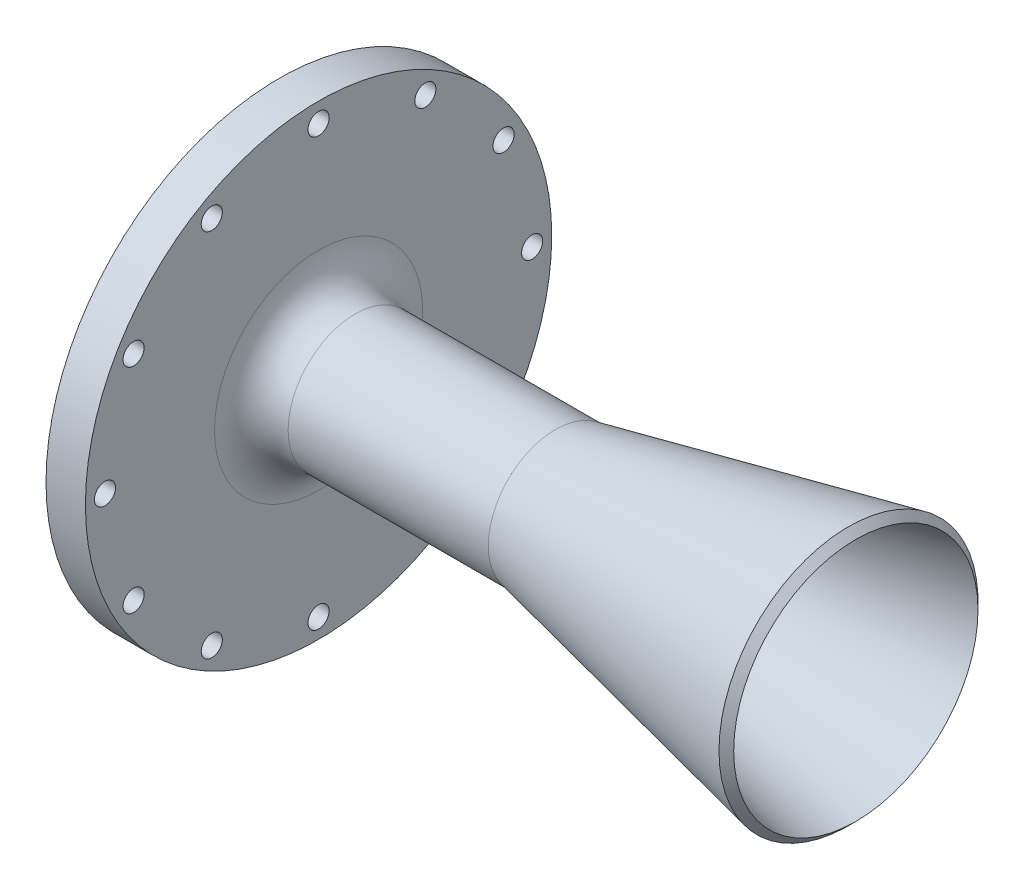
ISO-10303-21;
HEADER;
FILE_DESCRIPTION(('STEP AP214'),'2;1');
FILE_NAME('part.step','',(''),(''),'','','');
FILE_SCHEMA(('AUTOMOTIVE_DESIGN { 1 0 10303 214 1 1 1 1 }'));
ENDSEC;
DATA;
#1=APPLICATION_CONTEXT('core data for automotive mechanical design processes');
#2=APPLICATION_PROTOCOL_DEFINITION('international standard','automotive_design',2000,#1);
#3=PRODUCT_CONTEXT('',#1,'mechanical');
#4=PRODUCT('Part','Part','',(#3));
#5=PRODUCT_RELATED_PRODUCT_CATEGORY('part','',(#4));
#6=PRODUCT_DEFINITION_FORMATION('','',#4);
#7=PRODUCT_DEFINITION_CONTEXT('part definition',#1,'design');
#8=PRODUCT_DEFINITION('design','',#6,#7);
#9=PRODUCT_DEFINITION_SHAPE('','',#8);
#10=(LENGTH_UNIT() NAMED_UNIT(*) SI_UNIT(.MILLI.,.METRE.));
#11=(NAMED_UNIT(*) PLANE_ANGLE_UNIT() SI_UNIT($,.RADIAN.));
#12=(NAMED_UNIT(*) SI_UNIT($,.STERADIAN.) SOLID_ANGLE_UNIT());
#13=UNCERTAINTY_MEASURE_WITH_UNIT(LENGTH_MEASURE(1.E-05),#10,'distance_accuracy_value','');
#14=(GEOMETRIC_REPRESENTATION_CONTEXT(3) GLOBAL_UNCERTAINTY_ASSIGNED_CONTEXT((#13)) GLOBAL_UNIT_ASSIGNED_CONTEXT((#10,
#11,#12)) REPRESENTATION_CONTEXT('',''));
#15=CARTESIAN_POINT('',(0.,0.,0.));
#16=DIRECTION('',(0.,0.,1.));
#17=DIRECTION('',(1.,0.,0.));
#18=AXIS2_PLACEMENT_3D('',#15,#16,#17);
#19=CARTESIAN_POINT('',(0.,20.583496155902,0.));
#20=DIRECTION('',(1.,0.,0.));
#21=DIRECTION('',(0.,0.,-1.));
#22=AXIS2_PLACEMENT_3D('',#19,#20,#21);
#23=PLANE('',#22);
#24=CARTESIAN_POINT('',(0.,0.,0.));
#25=DIRECTION('',(1.,0.,0.));
#26=DIRECTION('',(0.,0.,-1.));
#27=AXIS2_PLACEMENT_3D('',#24,#25,#26);
#28=CIRCLE('',#27,36.);
#29=CARTESIAN_POINT('',(0.,0.,-36.));
#30=VERTEX_POINT('',#29);
#31=EDGE_CURVE('E212',#30,#30,#28,.T.);
#32=ORIENTED_EDGE('',*,*,#31,.T.);
#33=EDGE_LOOP('',(#32));
#34=FACE_BOUND('',#33,.T.);
#35=CARTESIAN_POINT('',(0.,0.,0.));
#36=DIRECTION('',(-1.,0.,0.));
#37=DIRECTION('',(0.,0.,1.));
#38=AXIS2_PLACEMENT_3D('',#35,#36,#37);
#39=CIRCLE('',#38,40.9575);
#40=CARTESIAN_POINT('',(0.,0.,40.9575));
#41=VERTEX_POINT('',#40);
#42=EDGE_CURVE('E566',#41,#41,#39,.T.);
#43=ORIENTED_EDGE('',*,*,#42,.T.);
#44=EDGE_LOOP('',(#43));
#45=FACE_BOUND('',#44,.T.);
#46=ADVANCED_FACE('F40',(#34,#45),#23,.F.);
#47=CARTESIAN_POINT('',(0.,0.,0.));
#48=DIRECTION('',(-1.,0.,0.));
#49=DIRECTION('',(0.,0.,1.));
#50=AXIS2_PLACEMENT_3D('',#47,#48,#49);
#51=CIRCLE('',#50,46.2915);
#52=CARTESIAN_POINT('',(0.,0.,46.2915));
#53=VERTEX_POINT('',#52);
#54=EDGE_CURVE('E570',#53,#53,#51,.T.);
#55=ORIENTED_EDGE('',*,*,#54,.F.);
#56=EDGE_LOOP('',(#55));
#57=FACE_BOUND('',#56,.T.);
#58=CARTESIAN_POINT('',(0.,-13.3616626129386,49.8664037450867));
#59=DIRECTION('',(-1.,0.,0.));
#60=DIRECTION('',(0.,0.,1.));
#61=AXIS2_PLACEMENT_3D('',#58,#59,#60);
#62=CIRCLE('',#61,2.38125);
#63=CARTESIAN_POINT('',(0.,-13.3616626129386,52.2476537450867));
#64=VERTEX_POINT('',#63);
#65=EDGE_CURVE('E67',#64,#64,#62,.T.);
#66=ORIENTED_EDGE('',*,*,#65,.F.);
#67=EDGE_LOOP('',(#66));
#68=FACE_BOUND('',#67,.T.);
#69=CARTESIAN_POINT('',(0.,13.3616626129382,-49.8664037450868));
#70=DIRECTION('',(-1.,0.,0.));
#71=DIRECTION('',(0.,0.,1.));
#72=AXIS2_PLACEMENT_3D('',#69,#70,#71);
#73=CIRCLE('',#72,2.38125);
#74=CARTESIAN_POINT('',(0.,13.3616626129382,-47.4851537450868));
#75=VERTEX_POINT('',#74);
#76=EDGE_CURVE('E66',#75,#75,#73,.T.);
#77=ORIENTED_EDGE('',*,*,#76,.F.);
#78=EDGE_LOOP('',(#77));
#79=FACE_BOUND('',#78,.T.);
#80=CARTESIAN_POINT('',(0.,-44.7089944830735,-25.81275));
#81=DIRECTION('',(-1.,0.,0.));
#82=DIRECTION('',(0.,0.,1.));
#83=AXIS2_PLACEMENT_3D('',#80,#81,#82);
#84=CIRCLE('',#83,2.5527);
#85=CARTESIAN_POINT('',(0.,-44.7089944830735,-23.26005));
#86=VERTEX_POINT('',#85);
#87=EDGE_CURVE('E90',#86,#86,#84,.T.);
#88=ORIENTED_EDGE('',*,*,#87,.F.);
#89=EDGE_LOOP('',(#88));
#90=FACE_BOUND('',#89,.T.);
#91=CARTESIAN_POINT('',(0.,-25.81275,-44.7089944830735));
#92=DIRECTION('',(-1.,0.,0.));
#93=DIRECTION('',(0.,0.,1.));
#94=AXIS2_PLACEMENT_3D('',#91,#92,#93);
#95=CIRCLE('',#94,2.5527);
#96=CARTESIAN_POINT('',(0.,-25.81275,-42.1562944830735));
#97=VERTEX_POINT('',#96);
#98=EDGE_CURVE('E98',#97,#97,#95,.T.);
#99=ORIENTED_EDGE('',*,*,#98,.F.);
#100=EDGE_LOOP('',(#99));
#101=FACE_BOUND('',#100,.T.);
#102=CARTESIAN_POINT('',(0.,0.,-51.6255));
#103=DIRECTION('',(-1.,0.,0.));
#104=DIRECTION('',(0.,0.,1.));
#105=AXIS2_PLACEMENT_3D('',#102,#103,#104);
#106=CIRCLE('',#105,2.5527);
#107=CARTESIAN_POINT('',(0.,0.,-49.0728));
#108=VERTEX_POINT('',#107);
#109=EDGE_CURVE('E106',#108,#108,#106,.T.);
#110=ORIENTED_EDGE('',*,*,#109,.F.);
#111=EDGE_LOOP('',(#110));
#112=FACE_BOUND('',#111,.T.);
#113=CARTESIAN_POINT('',(0.,25.81275,-44.7089944830735));
#114=DIRECTION('',(-1.,0.,0.));
#115=DIRECTION('',(0.,0.,1.));
#116=AXIS2_PLACEMENT_3D('',#113,#114,#115);
#117=CIRCLE('',#116,2.5527);
#118=CARTESIAN_POINT('',(0.,25.81275,-42.1562944830736));
#119=VERTEX_POINT('',#118);
#120=EDGE_CURVE('E114',#119,#119,#117,.T.);
#121=ORIENTED_EDGE('',*,*,#120,.F.);
#122=EDGE_LOOP('',(#121));
#123=FACE_BOUND('',#122,.T.);
#124=CARTESIAN_POINT('',(0.,44.7089944830735,-25.81275));
#125=DIRECTION('',(-1.,0.,0.));
#126=DIRECTION('',(0.,0.,1.));
#127=AXIS2_PLACEMENT_3D('',#124,#125,#126);
#128=CIRCLE('',#127,2.5527);
#129=CARTESIAN_POINT('',(0.,44.7089944830735,-23.26005));
#130=VERTEX_POINT('',#129);
#131=EDGE_CURVE('E122',#130,#130,#128,.T.);
#132=ORIENTED_EDGE('',*,*,#131,.F.);
#133=EDGE_LOOP('',(#132));
#134=FACE_BOUND('',#133,.T.);
#135=CARTESIAN_POINT('',(0.,51.6255,0.));
#136=DIRECTION('',(-1.,0.,0.));
#137=DIRECTION('',(0.,0.,1.));
#138=AXIS2_PLACEMENT_3D('',#135,#136,#137);
#139=CIRCLE('',#138,2.5527);
#140=CARTESIAN_POINT('',(0.,51.6255,2.5527));
#141=VERTEX_POINT('',#140);
#142=EDGE_CURVE('E130',#141,#141,#139,.T.);
#143=ORIENTED_EDGE('',*,*,#142,.F.);
#144=EDGE_LOOP('',(#143));
#145=FACE_BOUND('',#144,.T.);
#146=CARTESIAN_POINT('',(0.,25.81275,44.7089944830735));
#147=DIRECTION('',(-1.,0.,0.));
#148=DIRECTION('',(0.,0.,1.));
#149=AXIS2_PLACEMENT_3D('',#146,#147,#148);
#150=CIRCLE('',#149,2.5527);
#151=CARTESIAN_POINT('',(0.,25.81275,47.2616944830735));
#152=VERTEX_POINT('',#151);
#153=EDGE_CURVE('E146',#152,#152,#150,.T.);
#154=ORIENTED_EDGE('',*,*,#153,.F.);
#155=EDGE_LOOP('',(#154));
#156=FACE_BOUND('',#155,.T.);
#157=CARTESIAN_POINT('',(0.,0.,51.6255));
#158=DIRECTION('',(-1.,0.,0.));
#159=DIRECTION('',(0.,0.,1.));
#160=AXIS2_PLACEMENT_3D('',#157,#158,#159);
#161=CIRCLE('',#160,2.5527);
#162=CARTESIAN_POINT('',(0.,0.,54.1782));
#163=VERTEX_POINT('',#162);
#164=EDGE_CURVE('E154',#163,#163,#161,.T.);
#165=ORIENTED_EDGE('',*,*,#164,.F.);
#166=EDGE_LOOP('',(#165));
#167=FACE_BOUND('',#166,.T.);
#168=CARTESIAN_POINT('',(0.,-25.81275,44.7089944830736));
#169=DIRECTION('',(-1.,0.,0.));
#170=DIRECTION('',(0.,0.,1.));
#171=AXIS2_PLACEMENT_3D('',#168,#169,#170);
#172=CIRCLE('',#171,2.5527);
#173=CARTESIAN_POINT('',(0.,-25.81275,47.2616944830736));
#174=VERTEX_POINT('',#173);
#175=EDGE_CURVE('E162',#174,#174,#172,.T.);
#176=ORIENTED_EDGE('',*,*,#175,.F.);
#177=EDGE_LOOP('',(#176));
#178=FACE_BOUND('',#177,.T.);
#179=CARTESIAN_POINT('',(0.,-44.7089944830735,25.81275));
#180=DIRECTION('',(-1.,0.,0.));
#181=DIRECTION('',(0.,0.,1.));
#182=AXIS2_PLACEMENT_3D('',#179,#180,#181);
#183=CIRCLE('',#182,2.5527);
#184=CARTESIAN_POINT('',(0.,-44.7089944830735,28.36545));
#185=VERTEX_POINT('',#184);
#186=EDGE_CURVE('E170',#185,#185,#183,.T.);
#187=ORIENTED_EDGE('',*,*,#186,.F.);
#188=EDGE_LOOP('',(#187));
#189=FACE_BOUND('',#188,.T.);
#190=CARTESIAN_POINT('',(0.,0.,0.));
#191=DIRECTION('',(-1.,0.,0.));
#192=DIRECTION('',(0.,0.,1.));
#193=AXIS2_PLACEMENT_3D('',#190,#191,#192);
#194=CIRCLE('',#193,56.35625);
#195=CARTESIAN_POINT('',(0.,0.,56.35625));
#196=VERTEX_POINT('',#195);
#197=EDGE_CURVE('E186',#196,#196,#194,.T.);
#198=ORIENTED_EDGE('',*,*,#197,.T.);
#199=EDGE_LOOP('',(#198));
#200=FACE_BOUND('',#199,.T.);
#201=CARTESIAN_POINT('',(0.,44.7089944830735,25.81275));
#202=DIRECTION('',(-1.,0.,0.));
#203=DIRECTION('',(0.,0.,1.));
#204=AXIS2_PLACEMENT_3D('',#201,#202,#203);
#205=CIRCLE('',#204,2.5527);
#206=CARTESIAN_POINT('',(0.,44.7089944830735,28.36545));
#207=VERTEX_POINT('',#206);
#208=EDGE_CURVE('E138',#207,#207,#205,.T.);
#209=ORIENTED_EDGE('',*,*,#208,.F.);
#210=EDGE_LOOP('',(#209));
#211=FACE_BOUND('',#210,.T.);
#212=CARTESIAN_POINT('',(0.,-51.6255,0.));
#213=DIRECTION('',(-1.,0.,0.));
#214=DIRECTION('',(0.,0.,1.));
#215=AXIS2_PLACEMENT_3D('',#212,#213,#214);
#216=CIRCLE('',#215,2.5527);
#217=CARTESIAN_POINT('',(0.,-51.6255,2.5527));
#218=VERTEX_POINT('',#217);
#219=EDGE_CURVE('E82',#218,#218,#216,.T.);
#220=ORIENTED_EDGE('',*,*,#219,.F.);
#221=EDGE_LOOP('',(#220));
#222=FACE_BOUND('',#221,.T.);
#223=ADVANCED_FACE('F237',(#57,#68,#79,#90,#101,#112,#123,#134,#145,#156,#167,#178,#189,#200,
#211,#222),#23,.F.);
#224=CARTESIAN_POINT('',(60.325,0.,0.));
#225=DIRECTION('',(1.,0.,0.));
#226=DIRECTION('',(0.,0.,-1.));
#227=AXIS2_PLACEMENT_3D('',#224,#225,#226);
#228=CONICAL_SURFACE('',#227,12.7207818181818,0.20943951023932);
#229=CARTESIAN_POINT('',(139.384584692517,0.,0.));
#230=DIRECTION('',(1.,0.,0.));
#231=DIRECTION('',(0.,0.,-1.));
#232=AXIS2_PLACEMENT_3D('',#229,#230,#231);
#233=CIRCLE('',#232,29.5254153074831);
#234=CARTESIAN_POINT('',(139.384584692517,0.,-29.5254153074831));
#235=VERTEX_POINT('',#234);
#236=EDGE_CURVE('E11',#235,#235,#233,.T.);
#237=ORIENTED_EDGE('',*,*,#236,.T.);
#238=EDGE_LOOP('',(#237));
#239=FACE_BOUND('',#238,.T.);
#240=CARTESIAN_POINT('',(60.325,0.,0.));
#241=DIRECTION('',(-1.,0.,0.));
#242=DIRECTION('',(0.,0.,1.));
#243=AXIS2_PLACEMENT_3D('',#240,#241,#242);
#244=CIRCLE('',#243,12.7207818181818);
#245=CARTESIAN_POINT('',(60.325,0.,12.7207818181818));
#246=VERTEX_POINT('',#245);
#247=EDGE_CURVE('E198',#246,#246,#244,.T.);
#248=ORIENTED_EDGE('',*,*,#247,.T.);
#249=EDGE_LOOP('',(#248));
#250=FACE_BOUND('',#249,.T.);
#251=ADVANCED_FACE('F243',(#239,#250),#228,.F.);
#252=CARTESIAN_POINT('',(60.325,12.7207818181818,0.));
#253=DIRECTION('',(1.,0.,0.));
#254=DIRECTION('',(0.,0.,-1.));
#255=AXIS2_PLACEMENT_3D('',#252,#253,#254);
#256=PLANE('',#255);
#257=ORIENTED_EDGE('',*,*,#247,.F.);
#258=EDGE_LOOP('',(#257));
#259=FACE_BOUND('',#258,.T.);
#260=CARTESIAN_POINT('',(60.325,0.,0.));
#261=DIRECTION('',(-1.,0.,0.));
#262=DIRECTION('',(0.,0.,1.));
#263=AXIS2_PLACEMENT_3D('',#260,#261,#262);
#264=CIRCLE('',#263,14.351);
#265=CARTESIAN_POINT('',(60.325,0.,14.351));
#266=VERTEX_POINT('',#265);
#267=EDGE_CURVE('E194',#266,#266,#264,.T.);
#268=ORIENTED_EDGE('',*,*,#267,.T.);
#269=EDGE_LOOP('',(#268));
#270=FACE_BOUND('',#269,.T.);
#271=ADVANCED_FACE('F258',(#259,#270),#256,.F.);
#272=CARTESIAN_POINT('',(0.,0.,0.));
#273=DIRECTION('',(-1.,0.,0.));
#274=DIRECTION('',(0.,0.,1.));
#275=AXIS2_PLACEMENT_3D('',#272,#273,#274);
#276=CYLINDRICAL_SURFACE('',#275,14.351);
#277=ORIENTED_EDGE('',*,*,#267,.F.);
#278=EDGE_LOOP('',(#277));
#279=FACE_BOUND('',#278,.T.);
#280=CARTESIAN_POINT('',(10.795,0.,0.));
#281=DIRECTION('',(-1.,0.,0.));
#282=DIRECTION('',(0.,0.,1.));
#283=AXIS2_PLACEMENT_3D('',#280,#281,#282);
#284=CIRCLE('',#283,14.351);
#285=CARTESIAN_POINT('',(10.795,0.,14.351));
#286=VERTEX_POINT('',#285);
#287=EDGE_CURVE('E190',#286,#286,#284,.T.);
#288=ORIENTED_EDGE('',*,*,#287,.T.);
#289=EDGE_LOOP('',(#288));
#290=FACE_BOUND('',#289,.T.);
#291=ADVANCED_FACE('F254',(#279,#290),#276,.F.);
#292=CARTESIAN_POINT('',(0.,0.,0.));
#293=DIRECTION('',(-1.,0.,0.));
#294=DIRECTION('',(0.,0.,1.));
#295=AXIS2_PLACEMENT_3D('',#292,#293,#294);
#296=CONICAL_SURFACE('',#295,20.583496155902,0.5235987755983);
#297=CARTESIAN_POINT('',(1.42052217009252,0.,0.));
#298=DIRECTION('',(-1.,0.,0.));
#299=DIRECTION('',(0.,0.,1.));
#300=AXIS2_PLACEMENT_3D('',#297,#298,#299);
#301=CIRCLE('',#300,19.7633572986093);
#302=CARTESIAN_POINT('',(1.42052217009252,0.,19.7633572986093));
#303=VERTEX_POINT('',#302);
#304=EDGE_CURVE('E75',#303,#303,#301,.T.);
#305=ORIENTED_EDGE('',*,*,#304,.T.);
#306=EDGE_LOOP('',(#305));
#307=FACE_BOUND('',#306,.T.);
#308=ORIENTED_EDGE('',*,*,#287,.F.);
#309=EDGE_LOOP('',(#308));
#310=FACE_BOUND('',#309,.T.);
#311=ADVANCED_FACE('F251',(#307,#310),#296,.F.);
#312=CARTESIAN_POINT('',(0.,0.,0.));
#313=DIRECTION('',(-1.,0.,0.));
#314=DIRECTION('',(0.,0.,1.));
#315=AXIS2_PLACEMENT_3D('',#312,#313,#314);
#316=CYLINDRICAL_SURFACE('',#315,56.35625);
#317=ORIENTED_EDGE('',*,*,#197,.F.);
#318=EDGE_LOOP('',(#317));
#319=FACE_BOUND('',#318,.T.);
#320=CARTESIAN_POINT('',(9.525,0.,0.));
#321=DIRECTION('',(-1.,0.,0.));
#322=DIRECTION('',(0.,0.,1.));
#323=AXIS2_PLACEMENT_3D('',#320,#321,#322);
#324=CIRCLE('',#323,56.35625);
#325=CARTESIAN_POINT('',(9.525,0.,56.35625));
#326=VERTEX_POINT('',#325);
#327=EDGE_CURVE('E182',#326,#326,#324,.T.);
#328=ORIENTED_EDGE('',*,*,#327,.T.);
#329=EDGE_LOOP('',(#328));
#330=FACE_BOUND('',#329,.T.);
#331=ADVANCED_FACE('F249',(#319,#330),#316,.T.);
#332=CARTESIAN_POINT('',(9.525,56.35625,0.));
#333=DIRECTION('',(-1.,0.,0.));
#334=DIRECTION('',(0.,0.,1.));
#335=AXIS2_PLACEMENT_3D('',#332,#333,#334);
#336=PLANE('',#335);
#337=CARTESIAN_POINT('',(9.525,0.,0.));
#338=DIRECTION('',(-1.,0.,0.));
#339=DIRECTION('',(0.,0.,1.));
#340=AXIS2_PLACEMENT_3D('',#337,#338,#339);
#341=CIRCLE('',#340,25.146);
#342=CARTESIAN_POINT('',(9.525,0.,25.146));
#343=VERTEX_POINT('',#342);
#344=EDGE_CURVE('E202',#343,#343,#341,.T.);
#345=ORIENTED_EDGE('',*,*,#344,.T.);
#346=EDGE_LOOP('',(#345));
#347=FACE_BOUND('',#346,.T.);
#348=CARTESIAN_POINT('',(9.525,-51.6255,0.));
#349=DIRECTION('',(-1.,0.,0.));
#350=DIRECTION('',(0.,0.,1.));
#351=AXIS2_PLACEMENT_3D('',#348,#349,#350);
#352=CIRCLE('',#351,2.5527);
#353=CARTESIAN_POINT('',(9.525,-51.6255,2.5527));
#354=VERTEX_POINT('',#353);
#355=EDGE_CURVE('E86',#354,#354,#352,.T.);
#356=ORIENTED_EDGE('',*,*,#355,.T.);
#357=EDGE_LOOP('',(#356));
#358=FACE_BOUND('',#357,.T.);
#359=CARTESIAN_POINT('',(9.525,-44.7089944830735,-25.81275));
#360=DIRECTION('',(-1.,0.,0.));
#361=DIRECTION('',(0.,0.,1.));
#362=AXIS2_PLACEMENT_3D('',#359,#360,#361);
#363=CIRCLE('',#362,2.5527);
#364=CARTESIAN_POINT('',(9.525,-44.7089944830735,-23.26005));
#365=VERTEX_POINT('',#364);
#366=EDGE_CURVE('E94',#365,#365,#363,.T.);
#367=ORIENTED_EDGE('',*,*,#366,.T.);
#368=EDGE_LOOP('',(#367));
#369=FACE_BOUND('',#368,.T.);
#370=CARTESIAN_POINT('',(9.525,-25.81275,-44.7089944830735));
#371=DIRECTION('',(-1.,0.,0.));
#372=DIRECTION('',(0.,0.,1.));
#373=AXIS2_PLACEMENT_3D('',#370,#371,#372);
#374=CIRCLE('',#373,2.5527);
#375=CARTESIAN_POINT('',(9.525,-25.81275,-42.1562944830735));
#376=VERTEX_POINT('',#375);
#377=EDGE_CURVE('E102',#376,#376,#374,.T.);
#378=ORIENTED_EDGE('',*,*,#377,.T.);
#379=EDGE_LOOP('',(#378));
#380=FACE_BOUND('',#379,.T.);
#381=CARTESIAN_POINT('',(9.525,0.,-51.6255));
#382=DIRECTION('',(-1.,0.,0.));
#383=DIRECTION('',(0.,0.,1.));
#384=AXIS2_PLACEMENT_3D('',#381,#382,#383);
#385=CIRCLE('',#384,2.5527);
#386=CARTESIAN_POINT('',(9.525,0.,-49.0728));
#387=VERTEX_POINT('',#386);
#388=EDGE_CURVE('E110',#387,#387,#385,.T.);
#389=ORIENTED_EDGE('',*,*,#388,.T.);
#390=EDGE_LOOP('',(#389));
#391=FACE_BOUND('',#390,.T.);
#392=CARTESIAN_POINT('',(9.525,25.81275,-44.7089944830735));
#393=DIRECTION('',(-1.,0.,0.));
#394=DIRECTION('',(0.,0.,1.));
#395=AXIS2_PLACEMENT_3D('',#392,#393,#394);
#396=CIRCLE('',#395,2.5527);
#397=CARTESIAN_POINT('',(9.525,25.81275,-42.1562944830736));
#398=VERTEX_POINT('',#397);
#399=EDGE_CURVE('E118',#398,#398,#396,.T.);
#400=ORIENTED_EDGE('',*,*,#399,.T.);
#401=EDGE_LOOP('',(#400));
#402=FACE_BOUND('',#401,.T.);
#403=CARTESIAN_POINT('',(9.525,44.7089944830735,-25.81275));
#404=DIRECTION('',(-1.,0.,0.));
#405=DIRECTION('',(0.,0.,1.));
#406=AXIS2_PLACEMENT_3D('',#403,#404,#405);
#407=CIRCLE('',#406,2.5527);
#408=CARTESIAN_POINT('',(9.525,44.7089944830735,-23.26005));
#409=VERTEX_POINT('',#408);
#410=EDGE_CURVE('E126',#409,#409,#407,.T.);
#411=ORIENTED_EDGE('',*,*,#410,.T.);
#412=EDGE_LOOP('',(#411));
#413=FACE_BOUND('',#412,.T.);
#414=CARTESIAN_POINT('',(9.525,51.6255,0.));
#415=DIRECTION('',(-1.,0.,0.));
#416=DIRECTION('',(0.,0.,1.));
#417=AXIS2_PLACEMENT_3D('',#414,#415,#416);
#418=CIRCLE('',#417,2.5527);
#419=CARTESIAN_POINT('',(9.525,51.6255,2.5527));
#420=VERTEX_POINT('',#419);
#421=EDGE_CURVE('E134',#420,#420,#418,.T.);
#422=ORIENTED_EDGE('',*,*,#421,.T.);
#423=EDGE_LOOP('',(#422));
#424=FACE_BOUND('',#423,.T.);
#425=CARTESIAN_POINT('',(9.525,44.7089944830735,25.81275));
#426=DIRECTION('',(-1.,0.,0.));
#427=DIRECTION('',(0.,0.,1.));
#428=AXIS2_PLACEMENT_3D('',#425,#426,#427);
#429=CIRCLE('',#428,2.5527);
#430=CARTESIAN_POINT('',(9.525,44.7089944830735,28.36545));
#431=VERTEX_POINT('',#430);
#432=EDGE_CURVE('E142',#431,#431,#429,.T.);
#433=ORIENTED_EDGE('',*,*,#432,.T.);
#434=EDGE_LOOP('',(#433));
#435=FACE_BOUND('',#434,.T.);
#436=CARTESIAN_POINT('',(9.525,25.81275,44.7089944830735));
#437=DIRECTION('',(-1.,0.,0.));
#438=DIRECTION('',(0.,0.,1.));
#439=AXIS2_PLACEMENT_3D('',#436,#437,#438);
#440=CIRCLE('',#439,2.5527);
#441=CARTESIAN_POINT('',(9.525,25.81275,47.2616944830735));
#442=VERTEX_POINT('',#441);
#443=EDGE_CURVE('E150',#442,#442,#440,.T.);
#444=ORIENTED_EDGE('',*,*,#443,.T.);
#445=EDGE_LOOP('',(#444));
#446=FACE_BOUND('',#445,.T.);
#447=CARTESIAN_POINT('',(9.525,0.,51.6255));
#448=DIRECTION('',(-1.,0.,0.));
#449=DIRECTION('',(0.,0.,1.));
#450=AXIS2_PLACEMENT_3D('',#447,#448,#449);
#451=CIRCLE('',#450,2.5527);
#452=CARTESIAN_POINT('',(9.525,0.,54.1782));
#453=VERTEX_POINT('',#452);
#454=EDGE_CURVE('E158',#453,#453,#451,.T.);
#455=ORIENTED_EDGE('',*,*,#454,.T.);
#456=EDGE_LOOP('',(#455));
#457=FACE_BOUND('',#456,.T.);
#458=CARTESIAN_POINT('',(9.525,-25.81275,44.7089944830736));
#459=DIRECTION('',(-1.,0.,0.));
#460=DIRECTION('',(0.,0.,1.));
#461=AXIS2_PLACEMENT_3D('',#458,#459,#460);
#462=CIRCLE('',#461,2.5527);
#463=CARTESIAN_POINT('',(9.525,-25.81275,47.2616944830736));
#464=VERTEX_POINT('',#463);
#465=EDGE_CURVE('E166',#464,#464,#462,.T.);
#466=ORIENTED_EDGE('',*,*,#465,.T.);
#467=EDGE_LOOP('',(#466));
#468=FACE_BOUND('',#467,.T.);
#469=CARTESIAN_POINT('',(9.525,-44.7089944830735,25.81275));
#470=DIRECTION('',(-1.,0.,0.));
#471=DIRECTION('',(0.,0.,1.));
#472=AXIS2_PLACEMENT_3D('',#469,#470,#471);
#473=CIRCLE('',#472,2.5527);
#474=CARTESIAN_POINT('',(9.525,-44.7089944830735,28.36545));
#475=VERTEX_POINT('',#474);
#476=EDGE_CURVE('E174',#475,#475,#473,.T.);
#477=ORIENTED_EDGE('',*,*,#476,.T.);
#478=EDGE_LOOP('',(#477));
#479=FACE_BOUND('',#478,.T.);
#480=ORIENTED_EDGE('',*,*,#327,.F.);
#481=EDGE_LOOP('',(#480));
#482=FACE_BOUND('',#481,.T.);
#483=ADVANCED_FACE('F275',(#347,#358,#369,#380,#391,#402,#413,#424,#435,#446,#457,#468,#479,
#482),#336,.F.);
#484=CARTESIAN_POINT('',(0.,0.,0.));
#485=DIRECTION('',(-1.,0.,0.));
#486=DIRECTION('',(0.,0.,1.));
#487=AXIS2_PLACEMENT_3D('',#484,#485,#486);
#488=CYLINDRICAL_SURFACE('',#487,16.256);
#489=CARTESIAN_POINT('',(18.415,0.,0.));
#490=DIRECTION('',(-1.,0.,0.));
#491=DIRECTION('',(0.,0.,1.));
#492=AXIS2_PLACEMENT_3D('',#489,#490,#491);
#493=CIRCLE('',#492,16.256);
#494=CARTESIAN_POINT('',(18.415,0.,16.256));
#495=VERTEX_POINT('',#494);
#496=EDGE_CURVE('E206',#495,#495,#493,.F.);
#497=ORIENTED_EDGE('',*,*,#496,.T.);
#498=EDGE_LOOP('',(#497));
#499=FACE_BOUND('',#498,.T.);
#500=CARTESIAN_POINT('',(66.806461083741,0.,0.));
#501=DIRECTION('',(-1.,0.,0.));
#502=DIRECTION('',(0.,0.,1.));
#503=AXIS2_PLACEMENT_3D('',#500,#501,#502);
#504=CIRCLE('',#503,16.256);
#505=CARTESIAN_POINT('',(66.806461083741,0.,16.256));
#506=VERTEX_POINT('',#505);
#507=EDGE_CURVE('E178',#506,#506,#504,.T.);
#508=ORIENTED_EDGE('',*,*,#507,.T.);
#509=EDGE_LOOP('',(#508));
#510=FACE_BOUND('',#509,.T.);
#511=ADVANCED_FACE('F278',(#499,#510),#488,.T.);
#512=CARTESIAN_POINT('',(139.7,0.,0.));
#513=DIRECTION('',(1.,0.,0.));
#514=DIRECTION('',(0.,0.,-1.));
#515=AXIS2_PLACEMENT_3D('',#512,#513,#514);
#516=CONICAL_SURFACE('',#515,31.75,0.20943951023932);
#517=CARTESIAN_POINT('',(137.605252356639,0.,0.));
#518=DIRECTION('',(-1.,0.,0.));
#519=DIRECTION('',(0.,0.,1.));
#520=AXIS2_PLACEMENT_3D('',#517,#518,#519);
#521=CIRCLE('',#520,31.3047476433608);
#522=CARTESIAN_POINT('',(137.605252356639,0.,31.3047476433608));
#523=VERTEX_POINT('',#522);
#524=EDGE_CURVE('E49',#523,#523,#521,.T.);
#525=ORIENTED_EDGE('',*,*,#524,.T.);
#526=EDGE_LOOP('',(#525));
#527=FACE_BOUND('',#526,.T.);
#528=ORIENTED_EDGE('',*,*,#507,.F.);
#529=EDGE_LOOP('',(#528));
#530=FACE_BOUND('',#529,.T.);
#531=ADVANCED_FACE('F217',(#527,#530),#516,.T.);
#532=CARTESIAN_POINT('',(0.,-44.7089944830735,25.81275));
#533=DIRECTION('',(-1.,0.,0.));
#534=DIRECTION('',(0.,0.,1.));
#535=AXIS2_PLACEMENT_3D('',#532,#533,#534);
#536=CYLINDRICAL_SURFACE('',#535,2.5527);
#537=ORIENTED_EDGE('',*,*,#476,.F.);
#538=EDGE_LOOP('',(#537));
#539=FACE_BOUND('',#538,.T.);
#540=ORIENTED_EDGE('',*,*,#186,.T.);
#541=EDGE_LOOP('',(#540));
#542=FACE_BOUND('',#541,.T.);
#543=ADVANCED_FACE('F366',(#539,#542),#536,.F.);
#544=CARTESIAN_POINT('',(0.,-25.81275,44.7089944830736));
#545=DIRECTION('',(-1.,0.,0.));
#546=DIRECTION('',(0.,0.,1.));
#547=AXIS2_PLACEMENT_3D('',#544,#545,#546);
#548=CYLINDRICAL_SURFACE('',#547,2.5527);
#549=ORIENTED_EDGE('',*,*,#465,.F.);
#550=EDGE_LOOP('',(#549));
#551=FACE_BOUND('',#550,.T.);
#552=ORIENTED_EDGE('',*,*,#175,.T.);
#553=EDGE_LOOP('',(#552));
#554=FACE_BOUND('',#553,.T.);
#555=ADVANCED_FACE('F362',(#551,#554),#548,.F.);
#556=CARTESIAN_POINT('',(0.,0.,51.6255));
#557=DIRECTION('',(-1.,0.,0.));
#558=DIRECTION('',(0.,0.,1.));
#559=AXIS2_PLACEMENT_3D('',#556,#557,#558);
#560=CYLINDRICAL_SURFACE('',#559,2.5527);
#561=ORIENTED_EDGE('',*,*,#454,.F.);
#562=EDGE_LOOP('',(#561));
#563=FACE_BOUND('',#562,.T.);
#564=ORIENTED_EDGE('',*,*,#164,.T.);
#565=EDGE_LOOP('',(#564));
#566=FACE_BOUND('',#565,.T.);
#567=ADVANCED_FACE('F358',(#563,#566),#560,.F.);
#568=CARTESIAN_POINT('',(0.,25.81275,44.7089944830735));
#569=DIRECTION('',(-1.,0.,0.));
#570=DIRECTION('',(0.,0.,1.));
#571=AXIS2_PLACEMENT_3D('',#568,#569,#570);
#572=CYLINDRICAL_SURFACE('',#571,2.5527);
#573=ORIENTED_EDGE('',*,*,#443,.F.);
#574=EDGE_LOOP('',(#573));
#575=FACE_BOUND('',#574,.T.);
#576=ORIENTED_EDGE('',*,*,#153,.T.);
#577=EDGE_LOOP('',(#576));
#578=FACE_BOUND('',#577,.T.);
#579=ADVANCED_FACE('F354',(#575,#578),#572,.F.);
#580=CARTESIAN_POINT('',(0.,44.7089944830735,25.81275));
#581=DIRECTION('',(-1.,0.,0.));
#582=DIRECTION('',(0.,0.,1.));
#583=AXIS2_PLACEMENT_3D('',#580,#581,#582);
#584=CYLINDRICAL_SURFACE('',#583,2.5527);
#585=ORIENTED_EDGE('',*,*,#432,.F.);
#586=EDGE_LOOP('',(#585));
#587=FACE_BOUND('',#586,.T.);
#588=ORIENTED_EDGE('',*,*,#208,.T.);
#589=EDGE_LOOP('',(#588));
#590=FACE_BOUND('',#589,.T.);
#591=ADVANCED_FACE('F350',(#587,#590),#584,.F.);
#592=CARTESIAN_POINT('',(0.,51.6255,0.));
#593=DIRECTION('',(-1.,0.,0.));
#594=DIRECTION('',(0.,0.,1.));
#595=AXIS2_PLACEMENT_3D('',#592,#593,#594);
#596=CYLINDRICAL_SURFACE('',#595,2.5527);
#597=ORIENTED_EDGE('',*,*,#421,.F.);
#598=EDGE_LOOP('',(#597));
#599=FACE_BOUND('',#598,.T.);
#600=ORIENTED_EDGE('',*,*,#142,.T.);
#601=EDGE_LOOP('',(#600));
#602=FACE_BOUND('',#601,.T.);
#603=ADVANCED_FACE('F346',(#599,#602),#596,.F.);
#604=CARTESIAN_POINT('',(0.,44.7089944830735,-25.81275));
#605=DIRECTION('',(-1.,0.,0.));
#606=DIRECTION('',(0.,0.,1.));
#607=AXIS2_PLACEMENT_3D('',#604,#605,#606);
#608=CYLINDRICAL_SURFACE('',#607,2.5527);
#609=ORIENTED_EDGE('',*,*,#410,.F.);
#610=EDGE_LOOP('',(#609));
#611=FACE_BOUND('',#610,.T.);
#612=ORIENTED_EDGE('',*,*,#131,.T.);
#613=EDGE_LOOP('',(#612));
#614=FACE_BOUND('',#613,.T.);
#615=ADVANCED_FACE('F342',(#611,#614),#608,.F.);
#616=CARTESIAN_POINT('',(0.,25.81275,-44.7089944830735));
#617=DIRECTION('',(-1.,0.,0.));
#618=DIRECTION('',(0.,0.,1.));
#619=AXIS2_PLACEMENT_3D('',#616,#617,#618);
#620=CYLINDRICAL_SURFACE('',#619,2.5527);
#621=ORIENTED_EDGE('',*,*,#399,.F.);
#622=EDGE_LOOP('',(#621));
#623=FACE_BOUND('',#622,.T.);
#624=ORIENTED_EDGE('',*,*,#120,.T.);
#625=EDGE_LOOP('',(#624));
#626=FACE_BOUND('',#625,.T.);
#627=ADVANCED_FACE('F338',(#623,#626),#620,.F.);
#628=CARTESIAN_POINT('',(0.,0.,-51.6255));
#629=DIRECTION('',(-1.,0.,0.));
#630=DIRECTION('',(0.,0.,1.));
#631=AXIS2_PLACEMENT_3D('',#628,#629,#630);
#632=CYLINDRICAL_SURFACE('',#631,2.5527);
#633=ORIENTED_EDGE('',*,*,#388,.F.);
#634=EDGE_LOOP('',(#633));
#635=FACE_BOUND('',#634,.T.);
#636=ORIENTED_EDGE('',*,*,#109,.T.);
#637=EDGE_LOOP('',(#636));
#638=FACE_BOUND('',#637,.T.);
#639=ADVANCED_FACE('F334',(#635,#638),#632,.F.);
#640=CARTESIAN_POINT('',(0.,-25.81275,-44.7089944830735));
#641=DIRECTION('',(-1.,0.,0.));
#642=DIRECTION('',(0.,0.,1.));
#643=AXIS2_PLACEMENT_3D('',#640,#641,#642);
#644=CYLINDRICAL_SURFACE('',#643,2.5527);
#645=ORIENTED_EDGE('',*,*,#377,.F.);
#646=EDGE_LOOP('',(#645));
#647=FACE_BOUND('',#646,.T.);
#648=ORIENTED_EDGE('',*,*,#98,.T.);
#649=EDGE_LOOP('',(#648));
#650=FACE_BOUND('',#649,.T.);
#651=ADVANCED_FACE('F327',(#647,#650),#644,.F.);
#652=CARTESIAN_POINT('',(0.,-44.7089944830735,-25.81275));
#653=DIRECTION('',(-1.,0.,0.));
#654=DIRECTION('',(0.,0.,1.));
#655=AXIS2_PLACEMENT_3D('',#652,#653,#654);
#656=CYLINDRICAL_SURFACE('',#655,2.5527);
#657=ORIENTED_EDGE('',*,*,#366,.F.);
#658=EDGE_LOOP('',(#657));
#659=FACE_BOUND('',#658,.T.);
#660=ORIENTED_EDGE('',*,*,#87,.T.);
#661=EDGE_LOOP('',(#660));
#662=FACE_BOUND('',#661,.T.);
#663=ADVANCED_FACE('F319',(#659,#662),#656,.F.);
#664=CARTESIAN_POINT('',(0.,-51.6255,0.));
#665=DIRECTION('',(-1.,0.,0.));
#666=DIRECTION('',(0.,0.,1.));
#667=AXIS2_PLACEMENT_3D('',#664,#665,#666);
#668=CYLINDRICAL_SURFACE('',#667,2.5527);
#669=ORIENTED_EDGE('',*,*,#355,.F.);
#670=EDGE_LOOP('',(#669));
#671=FACE_BOUND('',#670,.T.);
#672=ORIENTED_EDGE('',*,*,#219,.T.);
#673=EDGE_LOOP('',(#672));
#674=FACE_BOUND('',#673,.T.);
#675=ADVANCED_FACE('F316',(#671,#674),#668,.F.);
#676=CARTESIAN_POINT('',(6.35,13.3616626129382,-49.8664037450868));
#677=DIRECTION('',(-1.,0.,0.));
#678=DIRECTION('',(0.,0.,1.));
#679=AXIS2_PLACEMENT_3D('',#676,#677,#678);
#680=CONICAL_SURFACE('',#679,2.38124999999999,1.02974425867665);
#681=CARTESIAN_POINT('',(7.78079934905938,13.3616626129382,-49.8664037450868));
#682=VERTEX_POINT('',#681);
#683=VERTEX_LOOP('',#682);
#684=FACE_BOUND('',#683,.T.);
#685=CARTESIAN_POINT('',(6.35,13.3616626129382,-49.8664037450868));
#686=DIRECTION('',(-1.,0.,0.));
#687=DIRECTION('',(0.,0.,1.));
#688=AXIS2_PLACEMENT_3D('',#685,#686,#687);
#689=CIRCLE('',#688,2.38124999999999);
#690=CARTESIAN_POINT('',(6.35,13.3616626129382,-47.4851537450868));
#691=VERTEX_POINT('',#690);
#692=EDGE_CURVE('E72',#691,#691,#689,.T.);
#693=ORIENTED_EDGE('',*,*,#692,.T.);
#694=EDGE_LOOP('',(#693));
#695=FACE_BOUND('',#694,.T.);
#696=ADVANCED_FACE('F318',(#684,#695),#680,.F.);
#697=CARTESIAN_POINT('',(0.,13.3616626129382,-49.8664037450868));
#698=DIRECTION('',(-1.,0.,0.));
#699=DIRECTION('',(0.,0.,1.));
#700=AXIS2_PLACEMENT_3D('',#697,#698,#699);
#701=CYLINDRICAL_SURFACE('',#700,2.38125);
#702=ORIENTED_EDGE('',*,*,#692,.F.);
#703=EDGE_LOOP('',(#702));
#704=FACE_BOUND('',#703,.T.);
#705=ORIENTED_EDGE('',*,*,#76,.T.);
#706=EDGE_LOOP('',(#705));
#707=FACE_BOUND('',#706,.T.);
#708=ADVANCED_FACE('F59',(#704,#707),#701,.F.);
#709=CARTESIAN_POINT('',(6.35,-13.3616626129386,49.8664037450867));
#710=DIRECTION('',(-1.,0.,0.));
#711=DIRECTION('',(0.,0.,1.));
#712=AXIS2_PLACEMENT_3D('',#709,#710,#711);
#713=CONICAL_SURFACE('',#712,2.38125,1.02974425867665);
#714=CARTESIAN_POINT('',(7.78079934905938,-13.3616626129386,49.8664037450867));
#715=VERTEX_POINT('',#714);
#716=VERTEX_LOOP('',#715);
#717=FACE_BOUND('',#716,.T.);
#718=CARTESIAN_POINT('',(6.35,-13.3616626129386,49.8664037450867));
#719=DIRECTION('',(-1.,0.,0.));
#720=DIRECTION('',(0.,0.,1.));
#721=AXIS2_PLACEMENT_3D('',#718,#719,#720);
#722=CIRCLE('',#721,2.38125);
#723=CARTESIAN_POINT('',(6.35,-13.3616626129386,52.2476537450867));
#724=VERTEX_POINT('',#723);
#725=EDGE_CURVE('E63',#724,#724,#722,.T.);
#726=ORIENTED_EDGE('',*,*,#725,.T.);
#727=EDGE_LOOP('',(#726));
#728=FACE_BOUND('',#727,.T.);
#729=ADVANCED_FACE('F55',(#717,#728),#713,.F.);
#730=CARTESIAN_POINT('',(0.,-13.3616626129386,49.8664037450867));
#731=DIRECTION('',(-1.,0.,0.));
#732=DIRECTION('',(0.,0.,1.));
#733=AXIS2_PLACEMENT_3D('',#730,#731,#732);
#734=CYLINDRICAL_SURFACE('',#733,2.38125);
#735=ORIENTED_EDGE('',*,*,#725,.F.);
#736=EDGE_LOOP('',(#735));
#737=FACE_BOUND('',#736,.T.);
#738=ORIENTED_EDGE('',*,*,#65,.T.);
#739=EDGE_LOOP('',(#738));
#740=FACE_BOUND('',#739,.T.);
#741=ADVANCED_FACE('F58',(#737,#740),#734,.F.);
#742=CARTESIAN_POINT('',(18.415,0.,0.));
#743=DIRECTION('',(-1.,0.,0.));
#744=DIRECTION('',(0.,0.,1.));
#745=AXIS2_PLACEMENT_3D('',#742,#743,#744);
#746=TOROIDAL_SURFACE('',#745,25.146,8.89);
#747=ORIENTED_EDGE('',*,*,#496,.F.);
#748=EDGE_LOOP('',(#747));
#749=FACE_BOUND('',#748,.T.);
#750=ORIENTED_EDGE('',*,*,#344,.F.);
#751=EDGE_LOOP('',(#750));
#752=FACE_BOUND('',#751,.T.);
#753=ADVANCED_FACE('F232',(#749,#752),#746,.F.);
#754=CARTESIAN_POINT('',(3.14959188693302,0.,0.));
#755=DIRECTION('',(-1.,0.,0.));
#756=DIRECTION('',(0.,0.,1.));
#757=AXIS2_PLACEMENT_3D('',#754,#755,#756);
#758=CONICAL_SURFACE('',#757,0.,1.48352986419519);
#759=ORIENTED_EDGE('',*,*,#31,.F.);
#760=EDGE_LOOP('',(#759));
#761=FACE_BOUND('',#760,.T.);
#762=ORIENTED_EDGE('',*,*,#304,.F.);
#763=EDGE_LOOP('',(#762));
#764=FACE_BOUND('',#763,.T.);
#765=ADVANCED_FACE('F222',(#761,#764),#758,.F.);
#766=CARTESIAN_POINT('',(137.605252356639,0.,0.));
#767=DIRECTION('',(-1.,0.,0.));
#768=DIRECTION('',(0.,0.,1.));
#769=AXIS2_PLACEMENT_3D('',#766,#767,#768);
#770=CONICAL_SURFACE('',#769,31.3047476433608,0.78539816339744);
#771=ORIENTED_EDGE('',*,*,#236,.F.);
#772=EDGE_LOOP('',(#771));
#773=FACE_BOUND('',#772,.T.);
#774=ORIENTED_EDGE('',*,*,#524,.F.);
#775=EDGE_LOOP('',(#774));
#776=FACE_BOUND('',#775,.T.);
#777=ADVANCED_FACE('F42',(#773,#776),#770,.T.);
#778=CARTESIAN_POINT('',(2.3876,0.,0.));
#779=DIRECTION('',(-1.,0.,0.));
#780=DIRECTION('',(0.,0.,1.));
#781=AXIS2_PLACEMENT_3D('',#778,#779,#780);
#782=CYLINDRICAL_SURFACE('',#781,46.2915);
#783=CARTESIAN_POINT('',(2.3876,0.,0.));
#784=DIRECTION('',(-1.,0.,0.));
#785=DIRECTION('',(0.,0.,1.));
#786=AXIS2_PLACEMENT_3D('',#783,#784,#785);
#787=CIRCLE('',#786,46.2915);
#788=CARTESIAN_POINT('',(2.3876,0.,46.2915));
#789=VERTEX_POINT('',#788);
#790=EDGE_CURVE('E573',#789,#789,#787,.T.);
#791=ORIENTED_EDGE('',*,*,#790,.F.);
#792=EDGE_LOOP('',(#791));
#793=FACE_BOUND('',#792,.T.);
#794=ORIENTED_EDGE('',*,*,#54,.T.);
#795=EDGE_LOOP('',(#794));
#796=FACE_BOUND('',#795,.T.);
#797=ADVANCED_FACE('F221',(#793,#796),#782,.F.);
#798=CARTESIAN_POINT('',(2.3876,0.,0.));
#799=DIRECTION('',(-1.,0.,0.));
#800=DIRECTION('',(0.,0.,1.));
#801=AXIS2_PLACEMENT_3D('',#798,#799,#800);
#802=PLANE('',#801);
#803=CARTESIAN_POINT('',(2.3876,0.,0.));
#804=DIRECTION('',(-1.,0.,0.));
#805=DIRECTION('',(0.,0.,1.));
#806=AXIS2_PLACEMENT_3D('',#803,#804,#805);
#807=CIRCLE('',#806,40.9575);
#808=CARTESIAN_POINT('',(2.3876,0.,40.9575));
#809=VERTEX_POINT('',#808);
#810=EDGE_CURVE('E563',#809,#809,#807,.T.);
#811=ORIENTED_EDGE('',*,*,#810,.F.);
#812=EDGE_LOOP('',(#811));
#813=FACE_BOUND('',#812,.T.);
#814=ORIENTED_EDGE('',*,*,#790,.T.);
#815=EDGE_LOOP('',(#814));
#816=FACE_BOUND('',#815,.T.);
#817=ADVANCED_FACE('F229',(#813,#816),#802,.T.);
#818=CARTESIAN_POINT('',(2.3876,0.,0.));
#819=DIRECTION('',(-1.,0.,0.));
#820=DIRECTION('',(0.,0.,1.));
#821=AXIS2_PLACEMENT_3D('',#818,#819,#820);
#822=CYLINDRICAL_SURFACE('',#821,40.9575);
#823=ORIENTED_EDGE('',*,*,#810,.T.);
#824=EDGE_LOOP('',(#823));
#825=FACE_BOUND('',#824,.T.);
#826=ORIENTED_EDGE('',*,*,#42,.F.);
#827=EDGE_LOOP('',(#826));
#828=FACE_BOUND('',#827,.T.);
#829=ADVANCED_FACE('F546',(#825,#828),#822,.T.);
#830=CLOSED_SHELL('',(#46,#223,#251,#271,#291,#311,#331,#483,#511,#531,#543,#555,#567,#579,#591,
#603,#615,#627,#639,#651,#663,#675,#696,#708,#729,#741,#753,#765,#777,#797,#817,#829));
#831=MANIFOLD_SOLID_BREP('B2',#830);
#832=ADVANCED_BREP_SHAPE_REPRESENTATION('',(#18,#831),#14);
#833=SHAPE_DEFINITION_REPRESENTATION(#9,#832);
ENDSEC;
END-ISO-10303-21;
